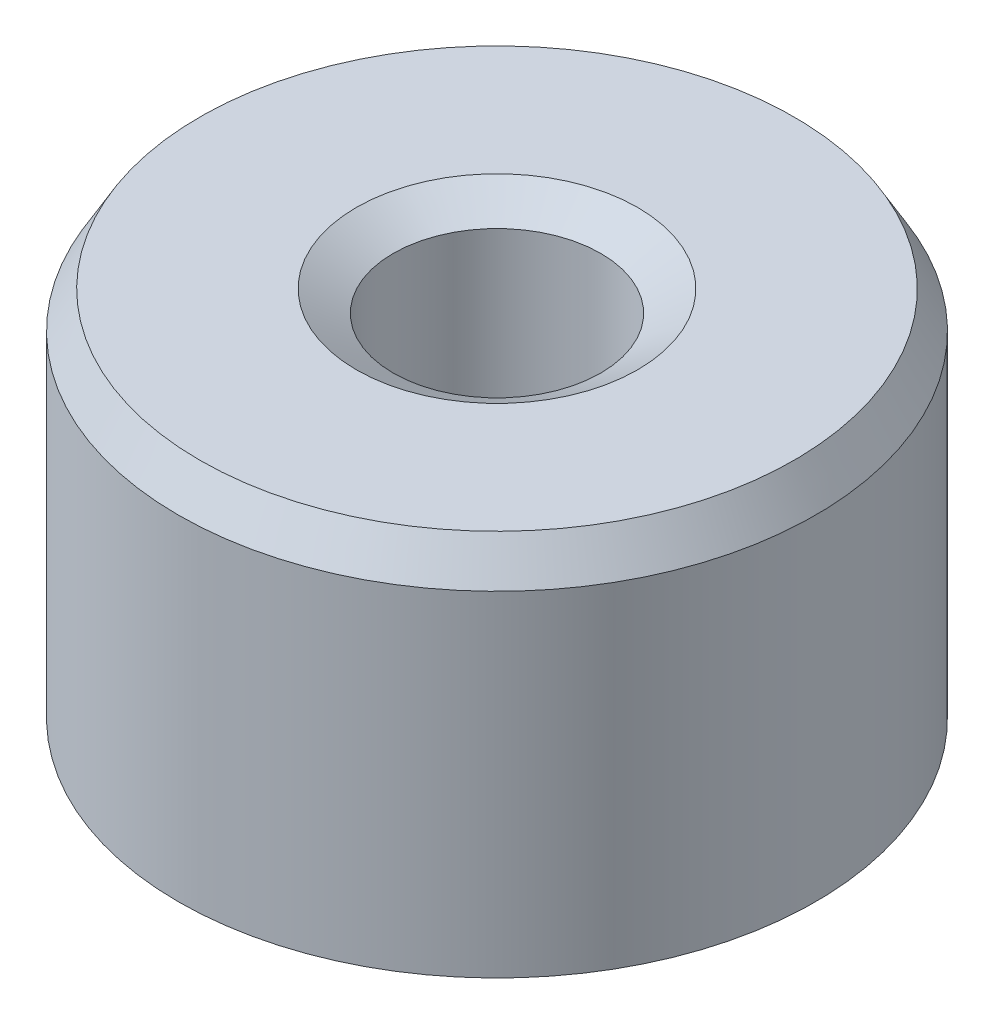
ISO-10303-21;
HEADER;
FILE_DESCRIPTION(('STEP AP214'),'2;1');
FILE_NAME('part.step','',(''),(''),'','','');
FILE_SCHEMA(('AUTOMOTIVE_DESIGN { 1 0 10303 214 1 1 1 1 }'));
ENDSEC;
DATA;
#1=APPLICATION_CONTEXT('core data for automotive mechanical design processes');
#2=APPLICATION_PROTOCOL_DEFINITION('international standard','automotive_design',2000,#1);
#3=PRODUCT_CONTEXT('',#1,'mechanical');
#4=PRODUCT('Part','Part','',(#3));
#5=PRODUCT_RELATED_PRODUCT_CATEGORY('part','',(#4));
#6=PRODUCT_DEFINITION_FORMATION('','',#4);
#7=PRODUCT_DEFINITION_CONTEXT('part definition',#1,'design');
#8=PRODUCT_DEFINITION('design','',#6,#7);
#9=PRODUCT_DEFINITION_SHAPE('','',#8);
#10=(LENGTH_UNIT() NAMED_UNIT(*) SI_UNIT(.MILLI.,.METRE.));
#11=(NAMED_UNIT(*) PLANE_ANGLE_UNIT() SI_UNIT($,.RADIAN.));
#12=(NAMED_UNIT(*) SI_UNIT($,.STERADIAN.) SOLID_ANGLE_UNIT());
#13=UNCERTAINTY_MEASURE_WITH_UNIT(LENGTH_MEASURE(1.E-05),#10,'distance_accuracy_value','');
#14=(GEOMETRIC_REPRESENTATION_CONTEXT(3) GLOBAL_UNCERTAINTY_ASSIGNED_CONTEXT((#13)) GLOBAL_UNIT_ASSIGNED_CONTEXT((#10,
#11,#12)) REPRESENTATION_CONTEXT('',''));
#15=CARTESIAN_POINT('',(0.,0.,0.));
#16=DIRECTION('',(0.,0.,1.));
#17=DIRECTION('',(1.,0.,0.));
#18=AXIS2_PLACEMENT_3D('',#15,#16,#17);
#19=CARTESIAN_POINT('',(0.,6.17055818788476,0.));
#20=DIRECTION('',(0.,-1.,0.));
#21=DIRECTION('',(0.,0.,-1.));
#22=AXIS2_PLACEMENT_3D('',#19,#20,#21);
#23=CYLINDRICAL_SURFACE('',#22,5.);
#24=CARTESIAN_POINT('',(0.,0.334543367045317,0.));
#25=DIRECTION('',(0.,1.,0.));
#26=DIRECTION('',(0.,0.,1.));
#27=AXIS2_PLACEMENT_3D('',#24,#25,#26);
#28=CIRCLE('',#27,5.);
#29=CARTESIAN_POINT('',(0.,0.334543367045317,5.));
#30=VERTEX_POINT('',#29);
#31=EDGE_CURVE('E10',#30,#30,#28,.T.);
#32=ORIENTED_EDGE('',*,*,#31,.T.);
#33=EDGE_LOOP('',(#32));
#34=FACE_BOUND('',#33,.T.);
#35=CARTESIAN_POINT('',(0.,5.5911120788271,0.));
#36=DIRECTION('',(0.,1.,0.));
#37=DIRECTION('',(0.,0.,1.));
#38=AXIS2_PLACEMENT_3D('',#35,#36,#37);
#39=CIRCLE('',#38,5.);
#40=CARTESIAN_POINT('',(0.,5.5911120788271,5.));
#41=VERTEX_POINT('',#40);
#42=EDGE_CURVE('E50',#41,#41,#39,.F.);
#43=ORIENTED_EDGE('',*,*,#42,.T.);
#44=EDGE_LOOP('',(#43));
#45=FACE_BOUND('',#44,.T.);
#46=ADVANCED_FACE('F39',(#34,#45),#23,.T.);
#47=CARTESIAN_POINT('',(0.,6.17055818788476,0.));
#48=DIRECTION('',(0.,1.,0.));
#49=DIRECTION('',(0.,0.,1.));
#50=AXIS2_PLACEMENT_3D('',#47,#48,#49);
#51=PLANE('',#50);
#52=CARTESIAN_POINT('',(0.,6.17055818788476,0.));
#53=DIRECTION('',(0.,1.,0.));
#54=DIRECTION('',(0.,0.,1.));
#55=AXIS2_PLACEMENT_3D('',#52,#53,#54);
#56=CIRCLE('',#55,2.20762222928789);
#57=CARTESIAN_POINT('',(0.,6.17055818788476,2.20762222928789));
#58=VERTEX_POINT('',#57);
#59=EDGE_CURVE('E58',#58,#58,#56,.F.);
#60=ORIENTED_EDGE('',*,*,#59,.T.);
#61=EDGE_LOOP('',(#60));
#62=FACE_BOUND('',#61,.T.);
#63=CARTESIAN_POINT('',(0.,6.17055818788476,0.));
#64=DIRECTION('',(0.,1.,0.));
#65=DIRECTION('',(0.,0.,1.));
#66=AXIS2_PLACEMENT_3D('',#63,#64,#65);
#67=CIRCLE('',#66,4.66545663295468);
#68=CARTESIAN_POINT('',(0.,6.17055818788476,4.66545663295468));
#69=VERTEX_POINT('',#68);
#70=EDGE_CURVE('E61',#69,#69,#67,.T.);
#71=ORIENTED_EDGE('',*,*,#70,.T.);
#72=EDGE_LOOP('',(#71));
#73=FACE_BOUND('',#72,.T.);
#74=ADVANCED_FACE('F88',(#62,#73),#51,.T.);
#75=CARTESIAN_POINT('',(0.,0.,0.));
#76=DIRECTION('',(0.,1.,0.));
#77=DIRECTION('',(0.,0.,1.));
#78=AXIS2_PLACEMENT_3D('',#75,#76,#77);
#79=PLANE('',#78);
#80=CARTESIAN_POINT('',(0.,0.,0.));
#81=DIRECTION('',(0.,1.,0.));
#82=DIRECTION('',(0.,0.,1.));
#83=AXIS2_PLACEMENT_3D('',#80,#81,#82);
#84=CIRCLE('',#83,1.96271948727555);
#85=CARTESIAN_POINT('',(0.,0.,1.96271948727555));
#86=VERTEX_POINT('',#85);
#87=EDGE_CURVE('E51',#86,#86,#84,.T.);
#88=ORIENTED_EDGE('',*,*,#87,.T.);
#89=EDGE_LOOP('',(#88));
#90=FACE_BOUND('',#89,.T.);
#91=CARTESIAN_POINT('',(0.,0.,0.));
#92=DIRECTION('',(0.,1.,0.));
#93=DIRECTION('',(0.,0.,1.));
#94=AXIS2_PLACEMENT_3D('',#91,#92,#93);
#95=CIRCLE('',#94,4.42055389094234);
#96=CARTESIAN_POINT('',(0.,0.,4.42055389094234));
#97=VERTEX_POINT('',#96);
#98=EDGE_CURVE('E54',#97,#97,#95,.F.);
#99=ORIENTED_EDGE('',*,*,#98,.T.);
#100=EDGE_LOOP('',(#99));
#101=FACE_BOUND('',#100,.T.);
#102=ADVANCED_FACE('F83',(#90,#101),#79,.F.);
#103=CARTESIAN_POINT('',(0.,6.17055818788476,0.));
#104=DIRECTION('',(0.,-1.,0.));
#105=DIRECTION('',(0.,0.,-1.));
#106=AXIS2_PLACEMENT_3D('',#103,#104,#105);
#107=CYLINDRICAL_SURFACE('',#106,1.62817612023023);
#108=CARTESIAN_POINT('',(0.,5.83601482083944,0.));
#109=DIRECTION('',(0.,1.,0.));
#110=DIRECTION('',(0.,0.,1.));
#111=AXIS2_PLACEMENT_3D('',#108,#109,#110);
#112=CIRCLE('',#111,1.62817612023023);
#113=CARTESIAN_POINT('',(0.,5.83601482083944,1.62817612023023));
#114=VERTEX_POINT('',#113);
#115=EDGE_CURVE('E67',#114,#114,#112,.T.);
#116=ORIENTED_EDGE('',*,*,#115,.T.);
#117=EDGE_LOOP('',(#116));
#118=FACE_BOUND('',#117,.T.);
#119=CARTESIAN_POINT('',(0.,0.579446109057658,0.));
#120=DIRECTION('',(0.,1.,0.));
#121=DIRECTION('',(0.,0.,1.));
#122=AXIS2_PLACEMENT_3D('',#119,#120,#121);
#123=CIRCLE('',#122,1.62817612023023);
#124=CARTESIAN_POINT('',(0.,0.579446109057658,1.62817612023023));
#125=VERTEX_POINT('',#124);
#126=EDGE_CURVE('E69',#125,#125,#123,.F.);
#127=ORIENTED_EDGE('',*,*,#126,.T.);
#128=EDGE_LOOP('',(#127));
#129=FACE_BOUND('',#128,.T.);
#130=ADVANCED_FACE('F71',(#118,#129),#107,.F.);
#131=CARTESIAN_POINT('',(0.,5.83601482083944,0.));
#132=DIRECTION('',(0.,1.,0.));
#133=DIRECTION('',(0.,0.,1.));
#134=AXIS2_PLACEMENT_3D('',#131,#132,#133);
#135=CONICAL_SURFACE('',#134,1.62817612023023,1.0471975511966);
#136=ORIENTED_EDGE('',*,*,#59,.F.);
#137=EDGE_LOOP('',(#136));
#138=FACE_BOUND('',#137,.T.);
#139=ORIENTED_EDGE('',*,*,#115,.F.);
#140=EDGE_LOOP('',(#139));
#141=FACE_BOUND('',#140,.T.);
#142=ADVANCED_FACE('F77',(#138,#141),#135,.F.);
#143=CARTESIAN_POINT('',(0.,0.,0.));
#144=DIRECTION('',(0.,-1.,0.));
#145=DIRECTION('',(0.,0.,-1.));
#146=AXIS2_PLACEMENT_3D('',#143,#144,#145);
#147=CONICAL_SURFACE('',#146,1.96271948727555,0.523598775598294);
#148=ORIENTED_EDGE('',*,*,#126,.F.);
#149=EDGE_LOOP('',(#148));
#150=FACE_BOUND('',#149,.T.);
#151=ORIENTED_EDGE('',*,*,#87,.F.);
#152=EDGE_LOOP('',(#151));
#153=FACE_BOUND('',#152,.T.);
#154=ADVANCED_FACE('F73',(#150,#153),#147,.F.);
#155=CARTESIAN_POINT('',(0.,0.334543367045317,0.));
#156=DIRECTION('',(0.,1.,0.));
#157=DIRECTION('',(0.,0.,1.));
#158=AXIS2_PLACEMENT_3D('',#155,#156,#157);
#159=CONICAL_SURFACE('',#158,5.,1.0471975511966);
#160=ORIENTED_EDGE('',*,*,#98,.F.);
#161=EDGE_LOOP('',(#160));
#162=FACE_BOUND('',#161,.T.);
#163=ORIENTED_EDGE('',*,*,#31,.F.);
#164=EDGE_LOOP('',(#163));
#165=FACE_BOUND('',#164,.T.);
#166=ADVANCED_FACE('F76',(#162,#165),#159,.T.);
#167=CARTESIAN_POINT('',(0.,6.17055818788476,0.));
#168=DIRECTION('',(0.,-1.,0.));
#169=DIRECTION('',(0.,0.,-1.));
#170=AXIS2_PLACEMENT_3D('',#167,#168,#169);
#171=CONICAL_SURFACE('',#170,4.66545663295468,0.523598775598295);
#172=ORIENTED_EDGE('',*,*,#42,.F.);
#173=EDGE_LOOP('',(#172));
#174=FACE_BOUND('',#173,.T.);
#175=ORIENTED_EDGE('',*,*,#70,.F.);
#176=EDGE_LOOP('',(#175));
#177=FACE_BOUND('',#176,.T.);
#178=ADVANCED_FACE('F45',(#174,#177),#171,.T.);
#179=CLOSED_SHELL('',(#46,#74,#102,#130,#142,#154,#166,#178));
#180=MANIFOLD_SOLID_BREP('B2',#179);
#181=ADVANCED_BREP_SHAPE_REPRESENTATION('',(#18,#180),#14);
#182=SHAPE_DEFINITION_REPRESENTATION(#9,#181);
ENDSEC;
END-ISO-10303-21;
